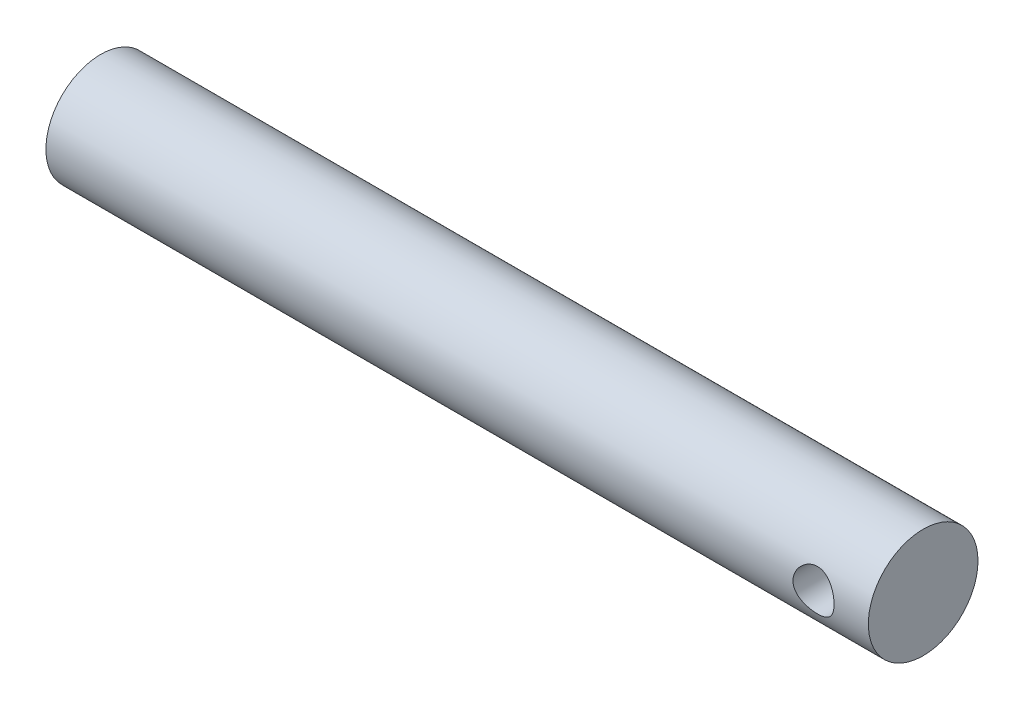
ISO-10303-21;
HEADER;
FILE_DESCRIPTION(('STEP AP214'),'2;1');
FILE_NAME('part.step','',(''),(''),'','','');
FILE_SCHEMA(('AUTOMOTIVE_DESIGN { 1 0 10303 214 1 1 1 1 }'));
ENDSEC;
DATA;
#1=APPLICATION_CONTEXT('core data for automotive mechanical design processes');
#2=APPLICATION_PROTOCOL_DEFINITION('international standard','automotive_design',2000,#1);
#3=PRODUCT_CONTEXT('',#1,'mechanical');
#4=PRODUCT('Part','Part','',(#3));
#5=PRODUCT_RELATED_PRODUCT_CATEGORY('part','',(#4));
#6=PRODUCT_DEFINITION_FORMATION('','',#4);
#7=PRODUCT_DEFINITION_CONTEXT('part definition',#1,'design');
#8=PRODUCT_DEFINITION('design','',#6,#7);
#9=PRODUCT_DEFINITION_SHAPE('','',#8);
#10=(LENGTH_UNIT() NAMED_UNIT(*) SI_UNIT(.MILLI.,.METRE.));
#11=(NAMED_UNIT(*) PLANE_ANGLE_UNIT() SI_UNIT($,.RADIAN.));
#12=(NAMED_UNIT(*) SI_UNIT($,.STERADIAN.) SOLID_ANGLE_UNIT());
#13=UNCERTAINTY_MEASURE_WITH_UNIT(LENGTH_MEASURE(1.E-05),#10,'distance_accuracy_value','');
#14=(GEOMETRIC_REPRESENTATION_CONTEXT(3) GLOBAL_UNCERTAINTY_ASSIGNED_CONTEXT((#13)) GLOBAL_UNIT_ASSIGNED_CONTEXT((#10,
#11,#12)) REPRESENTATION_CONTEXT('',''));
#15=CARTESIAN_POINT('',(0.,0.,0.));
#16=DIRECTION('',(0.,0.,1.));
#17=DIRECTION('',(1.,0.,0.));
#18=AXIS2_PLACEMENT_3D('',#15,#16,#17);
#19=CARTESIAN_POINT('',(95.25,0.,0.));
#20=DIRECTION('',(-1.,0.,0.));
#21=DIRECTION('',(0.,0.,1.));
#22=AXIS2_PLACEMENT_3D('',#19,#20,#21);
#23=CYLINDRICAL_SURFACE('',#22,6.35);
#24=CARTESIAN_POINT('',(91.28125,0.,6.35));
#25=CARTESIAN_POINT('',(91.2812546074062,-0.128960656063842,6.3500034521164));
#26=CARTESIAN_POINT('',(91.2707411306057,-0.257889758828596,6.34603727112054));
#27=CARTESIAN_POINT('',(91.229135240009,-0.511894855609375,6.33061179910997));
#28=CARTESIAN_POINT('',(91.198045790503,-0.636971401930343,6.31915358744214));
#29=CARTESIAN_POINT('',(91.1165421096873,-0.879571496173019,6.28997396421577));
#30=CARTESIAN_POINT('',(91.0661651545454,-0.997109105857609,6.27226463904736));
#31=CARTESIAN_POINT('',(90.9477060693374,-1.2220564048794,6.23234668827498));
#32=CARTESIAN_POINT('',(90.8796191904487,-1.32946336719488,6.21013685623732));
#33=CARTESIAN_POINT('',(90.7246526069249,-1.53566243706025,6.16245667066806));
#34=CARTESIAN_POINT('',(90.6371532086632,-1.63396728411503,6.1368940410141));
#35=CARTESIAN_POINT('',(90.4471609349791,-1.81490019090553,6.08584350633231));
#36=CARTESIAN_POINT('',(90.3446634872105,-1.89752345220235,6.06035562651864));
#37=CARTESIAN_POINT('',(90.1228235203069,-2.04784646017877,6.01126672105648));
#38=CARTESIAN_POINT('',(90.0029880681085,-2.11485786698269,5.98777455003049));
#39=CARTESIAN_POINT('',(89.7527282377575,-2.2275585105536,5.94677278126925));
#40=CARTESIAN_POINT('',(89.6223081134913,-2.27325626375968,5.92926079474211));
#41=CARTESIAN_POINT('',(89.3601896748401,-2.3401088424036,5.90318880358315));
#42=CARTESIAN_POINT('',(89.2287632514837,-2.36219354234461,5.89429104906955));
#43=CARTESIAN_POINT('',(88.9637918491848,-2.38410045993992,5.88546672569678));
#44=CARTESIAN_POINT('',(88.8302477679743,-2.38393187174176,5.88553645184146));
#45=CARTESIAN_POINT('',(88.5733408787244,-2.36204807005904,5.89434799715886));
#46=CARTESIAN_POINT('',(88.4498470616549,-2.34162296008043,5.90257056832905));
#47=CARTESIAN_POINT('',(88.2081878987316,-2.28193866490974,5.92589839169503));
#48=CARTESIAN_POINT('',(88.0900233582505,-2.24267664340423,5.94100468036945));
#49=CARTESIAN_POINT('',(87.8597476549814,-2.14572450857897,5.97671052227027));
#50=CARTESIAN_POINT('',(87.7477933157824,-2.08769979870147,5.99740859806213));
#51=CARTESIAN_POINT('',(87.5348361415743,-1.95510267098283,6.04193308596169));
#52=CARTESIAN_POINT('',(87.4338371056875,-1.88052453982124,6.06576057700738));
#53=CARTESIAN_POINT('',(87.2385166839542,-1.71103576966897,6.11581261688842));
#54=CARTESIAN_POINT('',(87.1451002828124,-1.61509549213167,6.14209064085877));
#55=CARTESIAN_POINT('',(86.9754134786483,-1.4086087379252,6.19270618460486));
#56=CARTESIAN_POINT('',(86.8991457108135,-1.29806002055207,6.21704340577199));
#57=CARTESIAN_POINT('',(86.7649229946633,-1.06318595622547,6.26151901759414));
#58=CARTESIAN_POINT('',(86.7072694648116,-0.938674008228492,6.2815866598714));
#59=CARTESIAN_POINT('',(86.6140276157213,-0.680778500207776,6.31473715344052));
#60=CARTESIAN_POINT('',(86.5784294962092,-0.547398909717655,6.3278231066712));
#61=CARTESIAN_POINT('',(86.5320488247772,-0.283170698498504,6.34499053624553));
#62=CARTESIAN_POINT('',(86.5200476123678,-0.152564496055006,6.34951373328277));
#63=CARTESIAN_POINT('',(86.5176529360589,0.108858804467352,6.3504110624895));
#64=CARTESIAN_POINT('',(86.5272546814971,0.239675849361106,6.34678700139145));
#65=CARTESIAN_POINT('',(86.566867192165,0.492541002091955,6.33208839264071));
#66=CARTESIAN_POINT('',(86.5960795756826,0.614732908211651,6.32130547652659));
#67=CARTESIAN_POINT('',(86.6730328901689,0.852395035994593,6.29366719883101));
#68=CARTESIAN_POINT('',(86.7207762309925,0.967864381176714,6.27681104747723));
#69=CARTESIAN_POINT('',(86.8349584297477,1.19260582711237,6.23807528747194));
#70=CARTESIAN_POINT('',(86.9019053951421,1.30159614514801,6.2160626283234));
#71=CARTESIAN_POINT('',(87.0520199887848,1.50716092986602,6.16944841108904));
#72=CARTESIAN_POINT('',(87.1351936054154,1.60373079092935,6.14484589877607));
#73=CARTESIAN_POINT('',(87.3210790438723,1.78757389300697,6.09398910566946));
#74=CARTESIAN_POINT('',(87.4246444651517,1.87398269671165,6.0677218069967));
#75=CARTESIAN_POINT('',(87.6453215732234,2.02836541925647,6.0178761999813));
#76=CARTESIAN_POINT('',(87.7624344750793,2.09633768270549,5.99429813321109));
#77=CARTESIAN_POINT('',(88.0078503790011,2.2119871546141,5.9525984234316));
#78=CARTESIAN_POINT('',(88.1361977841328,2.25957900646984,5.93449982021483));
#79=CARTESIAN_POINT('',(88.3999529998544,2.33216265003688,5.9063577721447));
#80=CARTESIAN_POINT('',(88.5353563874645,2.35716842360038,5.89630934428766));
#81=CARTESIAN_POINT('',(88.8000131532715,2.3826207601782,5.8860673298321));
#82=CARTESIAN_POINT('',(88.9291030528506,2.38454138749642,5.88528230680804));
#83=CARTESIAN_POINT('',(89.1856631895884,2.36754536081029,5.89213980233151));
#84=CARTESIAN_POINT('',(89.3131335791662,2.34863068262072,5.89978152177002));
#85=CARTESIAN_POINT('',(89.5588874724126,2.29164857313009,5.92213924766874));
#86=CARTESIAN_POINT('',(89.6773326246645,2.25418329827482,5.93663223035452));
#87=CARTESIAN_POINT('',(89.9063249947349,2.16169393638122,5.97092957922828));
#88=CARTESIAN_POINT('',(90.0168702073114,2.106665410501,5.99073528792403));
#89=CARTESIAN_POINT('',(90.233225028645,1.97726420551819,6.03471811697544));
#90=CARTESIAN_POINT('',(90.3384826399199,1.90202872074779,6.0590699627503));
#91=CARTESIAN_POINT('',(90.5353497280418,1.73568496096226,6.10879916727019));
#92=CARTESIAN_POINT('',(90.626954849974,1.64457164120333,6.13417684997243));
#93=CARTESIAN_POINT('',(90.7989706048672,1.44316512989559,6.18474799068186));
#94=CARTESIAN_POINT('',(90.8785072085776,1.33210084768812,6.20985716529773));
#95=CARTESIAN_POINT('',(91.0177609652515,1.0973009918313,6.25561541700536));
#96=CARTESIAN_POINT('',(91.0774765755315,0.973564432868858,6.2762641468935));
#97=CARTESIAN_POINT('',(91.1770732161142,0.711198542678667,6.31149189513105));
#98=CARTESIAN_POINT('',(91.2159832150555,0.572156307796804,6.3257693073889));
#99=CARTESIAN_POINT('',(91.2680625738741,0.288727727100132,6.34501909460094));
#100=CARTESIAN_POINT('',(91.2812448429861,0.144344098479214,6.34999613608798));
#101=CARTESIAN_POINT('',(91.28125,0.,6.35));
#102=B_SPLINE_CURVE_WITH_KNOTS('',3,(#24,#25,#26,#27,#28,#29,#30,#31,#32,#33,#34,#35,#36,#37,
#38,#39,#40,#41,#42,#43,#44,#45,#46,#47,#48,#49,#50,#51,#52,#53,#54,#55,#56,#57,#58,#59,#60,#61,
#62,#63,#64,#65,#66,#67,#68,#69,#70,#71,#72,#73,#74,#75,#76,#77,#78,#79,#80,#81,#82,#83,#84,#85,
#86,#87,#88,#89,#90,#91,#92,#93,#94,#95,#96,#97,#98,#99,#100,#101),.UNSPECIFIED.,.T.,.F.,(4,2,2,
2,2,2,2,2,2,2,2,2,2,2,2,2,2,2,2,2,2,2,2,2,2,2,2,2,2,2,2,2,2,2,2,2,2,2,4),(0.,0.38634955997739,
0.772643472379607,1.15819454862654,1.54384911513007,1.94426869500062,2.34481060319426,
2.76060970771384,3.17624252596513,3.57482575636833,3.97324430901536,4.34781872877956,
4.72244956671187,5.10416823314393,5.4860188530651,5.89353268420603,6.30110909424294,
6.71498808266645,7.12868303271919,7.52038468672033,7.91199948569953,8.28856670204098,
8.66518290541447,9.05286514702116,9.44069073281542,9.85101724635859,10.2613805903573,
10.6734461842944,11.0852565149346,11.470620370249,11.8559476846038,12.2295148860212,
12.6031765756721,12.9964254911628,13.3897995792034,13.8044607332579,14.219154153156,
14.6518076761337,15.0842440535135),.UNSPECIFIED.);
#103=CARTESIAN_POINT('',(91.28125,0.,6.35));
#104=VERTEX_POINT('',#103);
#105=EDGE_CURVE('E10',#104,#104,#102,.T.);
#106=ORIENTED_EDGE('',*,*,#105,.T.);
#107=EDGE_LOOP('',(#106));
#108=FACE_BOUND('',#107,.T.);
#109=CARTESIAN_POINT('',(91.28125,0.,-6.35));
#110=CARTESIAN_POINT('',(91.2812546074062,0.128960656063842,-6.3500034521164));
#111=CARTESIAN_POINT('',(91.2707411306057,0.257889758828596,-6.34603727112054));
#112=CARTESIAN_POINT('',(91.229135240009,0.511894855609375,-6.33061179910997));
#113=CARTESIAN_POINT('',(91.198045790503,0.636971401930343,-6.31915358744214));
#114=CARTESIAN_POINT('',(91.1165421096873,0.879571496173019,-6.28997396421577));
#115=CARTESIAN_POINT('',(91.0661651545454,0.997109105857609,-6.27226463904736));
#116=CARTESIAN_POINT('',(90.9477060693374,1.2220564048794,-6.23234668827498));
#117=CARTESIAN_POINT('',(90.8796191904487,1.32946336719488,-6.21013685623732));
#118=CARTESIAN_POINT('',(90.7246526069249,1.53566243706025,-6.16245667066806));
#119=CARTESIAN_POINT('',(90.6371532086632,1.63396728411503,-6.1368940410141));
#120=CARTESIAN_POINT('',(90.4471609349791,1.81490019090553,-6.08584350633231));
#121=CARTESIAN_POINT('',(90.3446634872105,1.89752345220235,-6.06035562651864));
#122=CARTESIAN_POINT('',(90.1228235203069,2.04784646017877,-6.01126672105648));
#123=CARTESIAN_POINT('',(90.0029880681085,2.11485786698269,-5.98777455003049));
#124=CARTESIAN_POINT('',(89.7527282377575,2.2275585105536,-5.94677278126925));
#125=CARTESIAN_POINT('',(89.6223081134913,2.27325626375968,-5.92926079474211));
#126=CARTESIAN_POINT('',(89.3601896748401,2.3401088424036,-5.90318880358315));
#127=CARTESIAN_POINT('',(89.2287632514837,2.36219354234461,-5.89429104906955));
#128=CARTESIAN_POINT('',(88.9637918491848,2.38410045993992,-5.88546672569678));
#129=CARTESIAN_POINT('',(88.8302477679743,2.38393187174176,-5.88553645184146));
#130=CARTESIAN_POINT('',(88.5733408787244,2.36204807005904,-5.89434799715886));
#131=CARTESIAN_POINT('',(88.4498470616549,2.34162296008043,-5.90257056832905));
#132=CARTESIAN_POINT('',(88.2081878987316,2.28193866490974,-5.92589839169503));
#133=CARTESIAN_POINT('',(88.0900233582505,2.24267664340423,-5.94100468036945));
#134=CARTESIAN_POINT('',(87.8597476549814,2.14572450857897,-5.97671052227027));
#135=CARTESIAN_POINT('',(87.7477933157824,2.08769979870147,-5.99740859806213));
#136=CARTESIAN_POINT('',(87.5348361415743,1.95510267098283,-6.04193308596169));
#137=CARTESIAN_POINT('',(87.4338371056875,1.88052453982124,-6.06576057700738));
#138=CARTESIAN_POINT('',(87.2385166839542,1.71103576966897,-6.11581261688842));
#139=CARTESIAN_POINT('',(87.1451002828124,1.61509549213167,-6.14209064085877));
#140=CARTESIAN_POINT('',(86.9754134786483,1.4086087379252,-6.19270618460486));
#141=CARTESIAN_POINT('',(86.8991457108135,1.29806002055207,-6.21704340577199));
#142=CARTESIAN_POINT('',(86.7649229946633,1.06318595622547,-6.26151901759414));
#143=CARTESIAN_POINT('',(86.7072694648116,0.938674008228492,-6.2815866598714));
#144=CARTESIAN_POINT('',(86.6140276157213,0.680778500207776,-6.31473715344052));
#145=CARTESIAN_POINT('',(86.5784294962092,0.547398909717655,-6.3278231066712));
#146=CARTESIAN_POINT('',(86.5320488247772,0.283170698498504,-6.34499053624553));
#147=CARTESIAN_POINT('',(86.5200476123678,0.152564496055006,-6.34951373328277));
#148=CARTESIAN_POINT('',(86.5176529360589,-0.108858804467352,-6.3504110624895));
#149=CARTESIAN_POINT('',(86.5272546814971,-0.239675849361106,-6.34678700139145));
#150=CARTESIAN_POINT('',(86.566867192165,-0.492541002091955,-6.33208839264071));
#151=CARTESIAN_POINT('',(86.5960795756826,-0.614732908211651,-6.32130547652659));
#152=CARTESIAN_POINT('',(86.6730328901689,-0.852395035994593,-6.29366719883101));
#153=CARTESIAN_POINT('',(86.7207762309925,-0.967864381176714,-6.27681104747723));
#154=CARTESIAN_POINT('',(86.8349584297477,-1.19260582711237,-6.23807528747194));
#155=CARTESIAN_POINT('',(86.9019053951421,-1.30159614514801,-6.2160626283234));
#156=CARTESIAN_POINT('',(87.0520199887848,-1.50716092986602,-6.16944841108904));
#157=CARTESIAN_POINT('',(87.1351936054154,-1.60373079092935,-6.14484589877607));
#158=CARTESIAN_POINT('',(87.3210790438723,-1.78757389300697,-6.09398910566946));
#159=CARTESIAN_POINT('',(87.4246444651517,-1.87398269671165,-6.0677218069967));
#160=CARTESIAN_POINT('',(87.6453215732234,-2.02836541925647,-6.0178761999813));
#161=CARTESIAN_POINT('',(87.7624344750793,-2.09633768270549,-5.99429813321109));
#162=CARTESIAN_POINT('',(88.0078503790011,-2.2119871546141,-5.9525984234316));
#163=CARTESIAN_POINT('',(88.1361977841328,-2.25957900646984,-5.93449982021483));
#164=CARTESIAN_POINT('',(88.3999529998544,-2.33216265003688,-5.9063577721447));
#165=CARTESIAN_POINT('',(88.5353563874645,-2.35716842360038,-5.89630934428766));
#166=CARTESIAN_POINT('',(88.8000131532715,-2.3826207601782,-5.8860673298321));
#167=CARTESIAN_POINT('',(88.9291030528506,-2.38454138749642,-5.88528230680804));
#168=CARTESIAN_POINT('',(89.1856631895884,-2.36754536081029,-5.89213980233151));
#169=CARTESIAN_POINT('',(89.3131335791662,-2.34863068262072,-5.89978152177002));
#170=CARTESIAN_POINT('',(89.5588874724126,-2.29164857313009,-5.92213924766874));
#171=CARTESIAN_POINT('',(89.6773326246645,-2.25418329827482,-5.93663223035452));
#172=CARTESIAN_POINT('',(89.9063249947349,-2.16169393638122,-5.97092957922828));
#173=CARTESIAN_POINT('',(90.0168702073114,-2.106665410501,-5.99073528792403));
#174=CARTESIAN_POINT('',(90.233225028645,-1.97726420551819,-6.03471811697544));
#175=CARTESIAN_POINT('',(90.3384826399199,-1.90202872074779,-6.0590699627503));
#176=CARTESIAN_POINT('',(90.5353497280418,-1.73568496096226,-6.10879916727019));
#177=CARTESIAN_POINT('',(90.626954849974,-1.64457164120333,-6.13417684997243));
#178=CARTESIAN_POINT('',(90.7989706048672,-1.44316512989559,-6.18474799068186));
#179=CARTESIAN_POINT('',(90.8785072085776,-1.33210084768812,-6.20985716529773));
#180=CARTESIAN_POINT('',(91.0177609652515,-1.0973009918313,-6.25561541700536));
#181=CARTESIAN_POINT('',(91.0774765755315,-0.973564432868858,-6.2762641468935));
#182=CARTESIAN_POINT('',(91.1770732161142,-0.711198542678667,-6.31149189513105));
#183=CARTESIAN_POINT('',(91.2159832150555,-0.572156307796804,-6.3257693073889));
#184=CARTESIAN_POINT('',(91.2680625738741,-0.288727727100132,-6.34501909460094));
#185=CARTESIAN_POINT('',(91.2812448429861,-0.144344098479214,-6.34999613608798));
#186=CARTESIAN_POINT('',(91.28125,0.,-6.35));
#187=B_SPLINE_CURVE_WITH_KNOTS('',3,(#109,#110,#111,#112,#113,#114,#115,#116,#117,#118,#119,
#120,#121,#122,#123,#124,#125,#126,#127,#128,#129,#130,#131,#132,#133,#134,#135,#136,#137,#138,
#139,#140,#141,#142,#143,#144,#145,#146,#147,#148,#149,#150,#151,#152,#153,#154,#155,#156,#157,
#158,#159,#160,#161,#162,#163,#164,#165,#166,#167,#168,#169,#170,#171,#172,#173,#174,#175,#176,
#177,#178,#179,#180,#181,#182,#183,#184,#185,#186),.UNSPECIFIED.,.T.,.F.,(4,2,2,2,2,2,2,2,2,2,2,
2,2,2,2,2,2,2,2,2,2,2,2,2,2,2,2,2,2,2,2,2,2,2,2,2,2,2,4),(0.,0.38634955997739,0.772643472379607,
1.15819454862654,1.54384911513007,1.94426869500062,2.34481060319426,2.76060970771384,
3.17624252596513,3.57482575636833,3.97324430901536,4.34781872877956,4.72244956671187,
5.10416823314393,5.4860188530651,5.89353268420603,6.30110909424294,6.71498808266645,
7.12868303271919,7.52038468672033,7.91199948569953,8.28856670204098,8.66518290541447,
9.05286514702116,9.44069073281542,9.85101724635859,10.2613805903573,10.6734461842944,
11.0852565149346,11.470620370249,11.8559476846038,12.2295148860212,12.6031765756721,
12.9964254911628,13.3897995792034,13.8044607332579,14.219154153156,14.6518076761337,
15.0842440535135),.UNSPECIFIED.);
#188=CARTESIAN_POINT('',(91.28125,0.,-6.35));
#189=VERTEX_POINT('',#188);
#190=EDGE_CURVE('E42',#189,#189,#187,.T.);
#191=ORIENTED_EDGE('',*,*,#190,.T.);
#192=EDGE_LOOP('',(#191));
#193=FACE_BOUND('',#192,.T.);
#194=CARTESIAN_POINT('',(95.25,0.,0.));
#195=DIRECTION('',(1.,0.,0.));
#196=DIRECTION('',(0.,0.,-1.));
#197=AXIS2_PLACEMENT_3D('',#194,#195,#196);
#198=CIRCLE('',#197,6.35);
#199=CARTESIAN_POINT('',(95.25,0.,-6.35));
#200=VERTEX_POINT('',#199);
#201=EDGE_CURVE('E46',#200,#200,#198,.T.);
#202=ORIENTED_EDGE('',*,*,#201,.F.);
#203=EDGE_LOOP('',(#202));
#204=FACE_BOUND('',#203,.T.);
#205=CARTESIAN_POINT('',(0.,0.,0.));
#206=DIRECTION('',(1.,0.,0.));
#207=DIRECTION('',(0.,0.,-1.));
#208=AXIS2_PLACEMENT_3D('',#205,#206,#207);
#209=CIRCLE('',#208,6.35);
#210=CARTESIAN_POINT('',(0.,0.,-6.35));
#211=VERTEX_POINT('',#210);
#212=EDGE_CURVE('E50',#211,#211,#209,.T.);
#213=ORIENTED_EDGE('',*,*,#212,.T.);
#214=EDGE_LOOP('',(#213));
#215=FACE_BOUND('',#214,.T.);
#216=ADVANCED_FACE('F32',(#108,#193,#204,#215),#23,.T.);
#217=CARTESIAN_POINT('',(95.25,0.,0.));
#218=DIRECTION('',(1.,0.,0.));
#219=DIRECTION('',(0.,0.,-1.));
#220=AXIS2_PLACEMENT_3D('',#217,#218,#219);
#221=PLANE('',#220);
#222=ORIENTED_EDGE('',*,*,#201,.T.);
#223=EDGE_LOOP('',(#222));
#224=FACE_BOUND('',#223,.T.);
#225=ADVANCED_FACE('F63',(#224),#221,.T.);
#226=CARTESIAN_POINT('',(0.,0.,0.));
#227=DIRECTION('',(1.,0.,0.));
#228=DIRECTION('',(0.,0.,-1.));
#229=AXIS2_PLACEMENT_3D('',#226,#227,#228);
#230=PLANE('',#229);
#231=ORIENTED_EDGE('',*,*,#212,.F.);
#232=EDGE_LOOP('',(#231));
#233=FACE_BOUND('',#232,.T.);
#234=ADVANCED_FACE('F59',(#233),#230,.F.);
#235=CARTESIAN_POINT('',(88.9,0.,-6.35));
#236=DIRECTION('',(0.,0.,1.));
#237=DIRECTION('',(1.,0.,0.));
#238=AXIS2_PLACEMENT_3D('',#235,#236,#237);
#239=CYLINDRICAL_SURFACE('',#238,2.38125000000001);
#240=ORIENTED_EDGE('',*,*,#190,.F.);
#241=EDGE_LOOP('',(#240));
#242=FACE_BOUND('',#241,.T.);
#243=ORIENTED_EDGE('',*,*,#105,.F.);
#244=EDGE_LOOP('',(#243));
#245=FACE_BOUND('',#244,.T.);
#246=ADVANCED_FACE('F55',(#242,#245),#239,.F.);
#247=CLOSED_SHELL('',(#216,#225,#234,#246));
#248=MANIFOLD_SOLID_BREP('B2',#247);
#249=ADVANCED_BREP_SHAPE_REPRESENTATION('',(#18,#248),#14);
#250=SHAPE_DEFINITION_REPRESENTATION(#9,#249);
ENDSEC;
END-ISO-10303-21;
